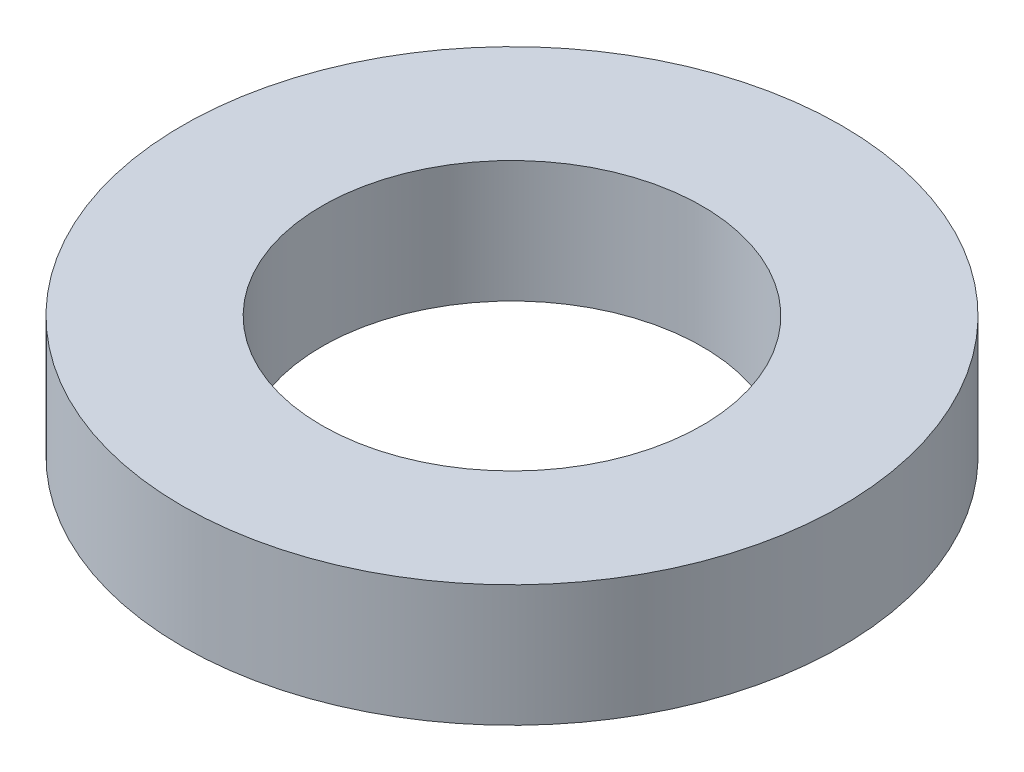
ISO-10303-21;
HEADER;
FILE_DESCRIPTION(('STEP AP214'),'2;1');
FILE_NAME('part.step','',(''),(''),'','','');
FILE_SCHEMA(('AUTOMOTIVE_DESIGN { 1 0 10303 214 1 1 1 1 }'));
ENDSEC;
DATA;
#1=APPLICATION_CONTEXT('core data for automotive mechanical design processes');
#2=APPLICATION_PROTOCOL_DEFINITION('international standard','automotive_design',2000,#1);
#3=PRODUCT_CONTEXT('',#1,'mechanical');
#4=PRODUCT('Part','Part','',(#3));
#5=PRODUCT_RELATED_PRODUCT_CATEGORY('part','',(#4));
#6=PRODUCT_DEFINITION_FORMATION('','',#4);
#7=PRODUCT_DEFINITION_CONTEXT('part definition',#1,'design');
#8=PRODUCT_DEFINITION('design','',#6,#7);
#9=PRODUCT_DEFINITION_SHAPE('','',#8);
#10=(LENGTH_UNIT() NAMED_UNIT(*) SI_UNIT(.MILLI.,.METRE.));
#11=(NAMED_UNIT(*) PLANE_ANGLE_UNIT() SI_UNIT($,.RADIAN.));
#12=(NAMED_UNIT(*) SI_UNIT($,.STERADIAN.) SOLID_ANGLE_UNIT());
#13=UNCERTAINTY_MEASURE_WITH_UNIT(LENGTH_MEASURE(1.E-05),#10,'distance_accuracy_value','');
#14=(GEOMETRIC_REPRESENTATION_CONTEXT(3) GLOBAL_UNCERTAINTY_ASSIGNED_CONTEXT((#13)) GLOBAL_UNIT_ASSIGNED_CONTEXT((#10,
#11,#12)) REPRESENTATION_CONTEXT('',''));
#15=CARTESIAN_POINT('',(0.,0.,0.));
#16=DIRECTION('',(0.,0.,1.));
#17=DIRECTION('',(1.,0.,0.));
#18=AXIS2_PLACEMENT_3D('',#15,#16,#17);
#19=CARTESIAN_POINT('',(0.,24.,0.));
#20=DIRECTION('',(0.,-1.,0.));
#21=DIRECTION('',(0.,0.,-1.));
#22=AXIS2_PLACEMENT_3D('',#19,#20,#21);
#23=CYLINDRICAL_SURFACE('',#22,65.);
#24=CARTESIAN_POINT('',(0.,24.,0.));
#25=DIRECTION('',(0.,1.,0.));
#26=DIRECTION('',(0.,0.,1.));
#27=AXIS2_PLACEMENT_3D('',#24,#25,#26);
#28=CIRCLE('',#27,65.);
#29=CARTESIAN_POINT('',(0.,24.,65.));
#30=VERTEX_POINT('',#29);
#31=EDGE_CURVE('E10',#30,#30,#28,.T.);
#32=ORIENTED_EDGE('',*,*,#31,.F.);
#33=EDGE_LOOP('',(#32));
#34=FACE_BOUND('',#33,.T.);
#35=CARTESIAN_POINT('',(0.,0.,0.));
#36=DIRECTION('',(0.,1.,0.));
#37=DIRECTION('',(0.,0.,1.));
#38=AXIS2_PLACEMENT_3D('',#35,#36,#37);
#39=CIRCLE('',#38,65.);
#40=CARTESIAN_POINT('',(0.,0.,65.));
#41=VERTEX_POINT('',#40);
#42=EDGE_CURVE('E37',#41,#41,#39,.T.);
#43=ORIENTED_EDGE('',*,*,#42,.T.);
#44=EDGE_LOOP('',(#43));
#45=FACE_BOUND('',#44,.T.);
#46=ADVANCED_FACE('F40',(#34,#45),#23,.T.);
#47=CARTESIAN_POINT('',(0.,24.,0.));
#48=DIRECTION('',(0.,1.,0.));
#49=DIRECTION('',(0.,0.,1.));
#50=AXIS2_PLACEMENT_3D('',#47,#48,#49);
#51=PLANE('',#50);
#52=CARTESIAN_POINT('',(0.,24.,0.));
#53=DIRECTION('',(0.,1.,0.));
#54=DIRECTION('',(0.,0.,1.));
#55=AXIS2_PLACEMENT_3D('',#52,#53,#54);
#56=CIRCLE('',#55,37.5);
#57=CARTESIAN_POINT('',(0.,24.,37.5));
#58=VERTEX_POINT('',#57);
#59=EDGE_CURVE('E50',#58,#58,#56,.T.);
#60=ORIENTED_EDGE('',*,*,#59,.F.);
#61=EDGE_LOOP('',(#60));
#62=FACE_BOUND('',#61,.T.);
#63=ORIENTED_EDGE('',*,*,#31,.T.);
#64=EDGE_LOOP('',(#63));
#65=FACE_BOUND('',#64,.T.);
#66=ADVANCED_FACE('F59',(#62,#65),#51,.T.);
#67=CARTESIAN_POINT('',(0.,0.,0.));
#68=DIRECTION('',(0.,1.,0.));
#69=DIRECTION('',(0.,0.,1.));
#70=AXIS2_PLACEMENT_3D('',#67,#68,#69);
#71=PLANE('',#70);
#72=CARTESIAN_POINT('',(0.,0.,0.));
#73=DIRECTION('',(0.,1.,0.));
#74=DIRECTION('',(0.,0.,1.));
#75=AXIS2_PLACEMENT_3D('',#72,#73,#74);
#76=CIRCLE('',#75,37.5);
#77=CARTESIAN_POINT('',(0.,0.,37.5));
#78=VERTEX_POINT('',#77);
#79=EDGE_CURVE('E47',#78,#78,#76,.T.);
#80=ORIENTED_EDGE('',*,*,#79,.T.);
#81=EDGE_LOOP('',(#80));
#82=FACE_BOUND('',#81,.T.);
#83=ORIENTED_EDGE('',*,*,#42,.F.);
#84=EDGE_LOOP('',(#83));
#85=FACE_BOUND('',#84,.T.);
#86=ADVANCED_FACE('F58',(#82,#85),#71,.F.);
#87=CARTESIAN_POINT('',(0.,24.,0.));
#88=DIRECTION('',(0.,-1.,0.));
#89=DIRECTION('',(0.,0.,-1.));
#90=AXIS2_PLACEMENT_3D('',#87,#88,#89);
#91=CYLINDRICAL_SURFACE('',#90,37.5);
#92=ORIENTED_EDGE('',*,*,#59,.T.);
#93=EDGE_LOOP('',(#92));
#94=FACE_BOUND('',#93,.T.);
#95=ORIENTED_EDGE('',*,*,#79,.F.);
#96=EDGE_LOOP('',(#95));
#97=FACE_BOUND('',#96,.T.);
#98=ADVANCED_FACE('F54',(#94,#97),#91,.F.);
#99=CLOSED_SHELL('',(#46,#66,#86,#98));
#100=MANIFOLD_SOLID_BREP('B2',#99);
#101=ADVANCED_BREP_SHAPE_REPRESENTATION('',(#18,#100),#14);
#102=SHAPE_DEFINITION_REPRESENTATION(#9,#101);
ENDSEC;
END-ISO-10303-21;
